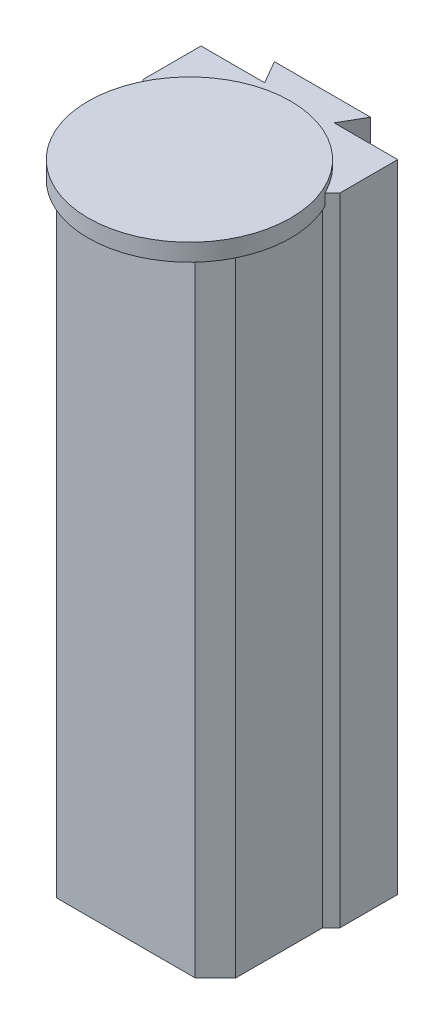
ISO-10303-21;
HEADER;
FILE_DESCRIPTION(('STEP AP214'),'2;1');
FILE_NAME('part.step','',(''),(''),'','','');
FILE_SCHEMA(('AUTOMOTIVE_DESIGN { 1 0 10303 214 1 1 1 1 }'));
ENDSEC;
DATA;
#1=APPLICATION_CONTEXT('core data for automotive mechanical design processes');
#2=APPLICATION_PROTOCOL_DEFINITION('international standard','automotive_design',2000,#1);
#3=PRODUCT_CONTEXT('',#1,'mechanical');
#4=PRODUCT('Part','Part','',(#3));
#5=PRODUCT_RELATED_PRODUCT_CATEGORY('part','',(#4));
#6=PRODUCT_DEFINITION_FORMATION('','',#4);
#7=PRODUCT_DEFINITION_CONTEXT('part definition',#1,'design');
#8=PRODUCT_DEFINITION('design','',#6,#7);
#9=PRODUCT_DEFINITION_SHAPE('','',#8);
#10=(LENGTH_UNIT() NAMED_UNIT(*) SI_UNIT(.MILLI.,.METRE.));
#11=(NAMED_UNIT(*) PLANE_ANGLE_UNIT() SI_UNIT($,.RADIAN.));
#12=(NAMED_UNIT(*) SI_UNIT($,.STERADIAN.) SOLID_ANGLE_UNIT());
#13=UNCERTAINTY_MEASURE_WITH_UNIT(LENGTH_MEASURE(1.E-05),#10,'distance_accuracy_value','');
#14=(GEOMETRIC_REPRESENTATION_CONTEXT(3) GLOBAL_UNCERTAINTY_ASSIGNED_CONTEXT((#13)) GLOBAL_UNIT_ASSIGNED_CONTEXT((#10,
#11,#12)) REPRESENTATION_CONTEXT('',''));
#15=CARTESIAN_POINT('',(0.,0.,0.));
#16=DIRECTION('',(0.,0.,1.));
#17=DIRECTION('',(1.,0.,0.));
#18=AXIS2_PLACEMENT_3D('',#15,#16,#17);
#19=CARTESIAN_POINT('',(0.,-230.,0.));
#20=DIRECTION('',(0.,1.,0.));
#21=DIRECTION('',(0.,0.,1.));
#22=AXIS2_PLACEMENT_3D('',#19,#20,#21);
#23=PLANE('',#22);
#24=CARTESIAN_POINT('',(0.,-230.,580.));
#25=DIRECTION('',(0.,1.,0.));
#26=DIRECTION('',(0.,0.,1.));
#27=AXIS2_PLACEMENT_3D('',#24,#25,#26);
#28=CIRCLE('',#27,175.);
#29=CARTESIAN_POINT('',(0.,-230.,755.));
#30=VERTEX_POINT('',#29);
#31=EDGE_CURVE('E19',#30,#30,#28,.F.);
#32=ORIENTED_EDGE('',*,*,#31,.F.);
#33=EDGE_LOOP('',(#32));
#34=FACE_BOUND('',#33,.T.);
#35=ADVANCED_FACE('F16',(#34),#23,.T.);
#36=CARTESIAN_POINT('',(0.,-240.,0.));
#37=DIRECTION('',(0.,1.,0.));
#38=DIRECTION('',(0.,0.,1.));
#39=AXIS2_PLACEMENT_3D('',#36,#37,#38);
#40=PLANE('',#39);
#41=DIRECTION('',(-0.707106781186548,0.,-0.707106781186548));
#42=VECTOR('',#41,1.);
#43=CARTESIAN_POINT('',(-170.,-240.,490.));
#44=LINE('',#43,#42);
#45=CARTESIAN_POINT('',(-170.,-240.,490.));
#46=VERTEX_POINT('',#45);
#47=CARTESIAN_POINT('',(-157.100384286152,-240.,502.899615713848));
#48=VERTEX_POINT('',#47);
#49=EDGE_CURVE('E135',#46,#48,#44,.F.);
#50=ORIENTED_EDGE('',*,*,#49,.T.);
#51=CARTESIAN_POINT('',(0.,-240.,580.));
#52=DIRECTION('',(0.,1.,0.));
#53=DIRECTION('',(0.,0.,1.));
#54=AXIS2_PLACEMENT_3D('',#51,#52,#53);
#55=CIRCLE('',#54,175.);
#56=CARTESIAN_POINT('',(157.100384286152,-240.,502.899615713848));
#57=VERTEX_POINT('',#56);
#58=EDGE_CURVE('E128',#57,#48,#55,.T.);
#59=ORIENTED_EDGE('',*,*,#58,.F.);
#60=DIRECTION('',(0.707106781186548,0.,-0.707106781186548));
#61=VECTOR('',#60,1.);
#62=CARTESIAN_POINT('',(170.,-240.,490.));
#63=LINE('',#62,#61);
#64=CARTESIAN_POINT('',(170.,-240.,490.));
#65=VERTEX_POINT('',#64);
#66=EDGE_CURVE('E132',#65,#57,#63,.F.);
#67=ORIENTED_EDGE('',*,*,#66,.F.);
#68=DIRECTION('',(0.,0.,1.));
#69=VECTOR('',#68,1.);
#70=CARTESIAN_POINT('',(170.,-240.,490.));
#71=LINE('',#70,#69);
#72=CARTESIAN_POINT('',(170.,-240.,390.));
#73=VERTEX_POINT('',#72);
#74=EDGE_CURVE('E160',#65,#73,#71,.F.);
#75=ORIENTED_EDGE('',*,*,#74,.T.);
#76=DIRECTION('',(1.,0.,0.));
#77=VECTOR('',#76,1.);
#78=CARTESIAN_POINT('',(-60.,-240.,390.));
#79=LINE('',#78,#77);
#80=CARTESIAN_POINT('',(60.,-240.,390.));
#81=VERTEX_POINT('',#80);
#82=EDGE_CURVE('E174',#73,#81,#79,.F.);
#83=ORIENTED_EDGE('',*,*,#82,.T.);
#84=DIRECTION('',(-0.50000000000019,0.,0.866025403784329));
#85=VECTOR('',#84,1.);
#86=CARTESIAN_POINT('',(60.,-240.,390.));
#87=LINE('',#86,#85);
#88=CARTESIAN_POINT('',(83.0940107675992,-240.,350.));
#89=VERTEX_POINT('',#88);
#90=EDGE_CURVE('E219',#81,#89,#87,.F.);
#91=ORIENTED_EDGE('',*,*,#90,.T.);
#92=DIRECTION('',(-1.,0.,0.));
#93=VECTOR('',#92,1.);
#94=CARTESIAN_POINT('',(-83.0940107676,-240.,350.));
#95=LINE('',#94,#93);
#96=CARTESIAN_POINT('',(-83.0940107675976,-240.,350.));
#97=VERTEX_POINT('',#96);
#98=EDGE_CURVE('E216',#97,#89,#95,.F.);
#99=ORIENTED_EDGE('',*,*,#98,.F.);
#100=DIRECTION('',(0.50000000000019,0.,0.866025403784329));
#101=VECTOR('',#100,1.);
#102=CARTESIAN_POINT('',(-60.,-240.,390.));
#103=LINE('',#102,#101);
#104=CARTESIAN_POINT('',(-60.,-240.,390.));
#105=VERTEX_POINT('',#104);
#106=EDGE_CURVE('E196',#105,#97,#103,.F.);
#107=ORIENTED_EDGE('',*,*,#106,.F.);
#108=DIRECTION('',(1.,0.,0.));
#109=VECTOR('',#108,1.);
#110=CARTESIAN_POINT('',(-60.,-240.,390.));
#111=LINE('',#110,#109);
#112=CARTESIAN_POINT('',(-170.,-240.,390.));
#113=VERTEX_POINT('',#112);
#114=EDGE_CURVE('E186',#105,#113,#111,.F.);
#115=ORIENTED_EDGE('',*,*,#114,.T.);
#116=DIRECTION('',(0.,0.,1.));
#117=VECTOR('',#116,1.);
#118=CARTESIAN_POINT('',(-170.,-240.,490.));
#119=LINE('',#118,#117);
#120=EDGE_CURVE('E183',#46,#113,#119,.F.);
#121=ORIENTED_EDGE('',*,*,#120,.F.);
#122=EDGE_LOOP('',(#50,#59,#67,#75,#83,#91,#99,#107,#115,#121));
#123=FACE_BOUND('',#122,.T.);
#124=ADVANCED_FACE('F130',(#123),#40,.T.);
#125=CARTESIAN_POINT('',(60.,-340.,390.));
#126=DIRECTION('',(-0.866025403784329,0.,-0.50000000000019));
#127=DIRECTION('',(-0.50000000000019,0.,0.866025403784329));
#128=AXIS2_PLACEMENT_3D('',#125,#126,#127);
#129=PLANE('',#128);
#130=DIRECTION('',(0.,1.,0.));
#131=VECTOR('',#130,1.);
#132=CARTESIAN_POINT('',(83.0940107676,-340.,350.));
#133=LINE('',#132,#131);
#134=CARTESIAN_POINT('',(83.0940107675988,-1340.,350.));
#135=VERTEX_POINT('',#134);
#136=EDGE_CURVE('E199',#89,#135,#133,.F.);
#137=ORIENTED_EDGE('',*,*,#136,.F.);
#138=ORIENTED_EDGE('',*,*,#90,.F.);
#139=DIRECTION('',(0.,1.,0.));
#140=VECTOR('',#139,1.);
#141=CARTESIAN_POINT('',(60.,-340.,390.));
#142=LINE('',#141,#140);
#143=CARTESIAN_POINT('',(60.,-1340.,390.));
#144=VERTEX_POINT('',#143);
#145=EDGE_CURVE('E178',#81,#144,#142,.F.);
#146=ORIENTED_EDGE('',*,*,#145,.T.);
#147=DIRECTION('',(0.500000000000243,0.,-0.866025403784298));
#148=VECTOR('',#147,1.);
#149=CARTESIAN_POINT('',(60.,-1340.,390.));
#150=LINE('',#149,#148);
#151=EDGE_CURVE('E247',#144,#135,#150,.T.);
#152=ORIENTED_EDGE('',*,*,#151,.T.);
#153=EDGE_LOOP('',(#137,#138,#146,#152));
#154=FACE_BOUND('',#153,.T.);
#155=ADVANCED_FACE('F333',(#154),#129,.F.);
#156=CARTESIAN_POINT('',(-83.0940107676,-340.,350.));
#157=DIRECTION('',(0.,0.,-1.));
#158=DIRECTION('',(-1.,0.,0.));
#159=AXIS2_PLACEMENT_3D('',#156,#157,#158);
#160=PLANE('',#159);
#161=ORIENTED_EDGE('',*,*,#98,.T.);
#162=ORIENTED_EDGE('',*,*,#136,.T.);
#163=DIRECTION('',(1.,0.,0.));
#164=VECTOR('',#163,1.);
#165=CARTESIAN_POINT('',(0.,-1340.,350.));
#166=LINE('',#165,#164);
#167=CARTESIAN_POINT('',(-83.0940107675994,-1340.,350.));
#168=VERTEX_POINT('',#167);
#169=EDGE_CURVE('E205',#135,#168,#166,.F.);
#170=ORIENTED_EDGE('',*,*,#169,.T.);
#171=DIRECTION('',(0.,1.,0.));
#172=VECTOR('',#171,1.);
#173=CARTESIAN_POINT('',(-83.0940107675976,-340.,350.));
#174=LINE('',#173,#172);
#175=EDGE_CURVE('E193',#97,#168,#174,.F.);
#176=ORIENTED_EDGE('',*,*,#175,.F.);
#177=EDGE_LOOP('',(#161,#162,#170,#176));
#178=FACE_BOUND('',#177,.T.);
#179=ADVANCED_FACE('F337',(#178),#160,.T.);
#180=CARTESIAN_POINT('',(-60.,-340.,390.));
#181=DIRECTION('',(-0.866025403784329,0.,0.50000000000019));
#182=DIRECTION('',(0.50000000000019,0.,0.866025403784329));
#183=AXIS2_PLACEMENT_3D('',#180,#181,#182);
#184=PLANE('',#183);
#185=ORIENTED_EDGE('',*,*,#106,.T.);
#186=ORIENTED_EDGE('',*,*,#175,.T.);
#187=DIRECTION('',(0.500000000000243,0.,0.866025403784298));
#188=VECTOR('',#187,1.);
#189=CARTESIAN_POINT('',(-83.0940107676,-1340.,350.));
#190=LINE('',#189,#188);
#191=CARTESIAN_POINT('',(-60.,-1340.,390.));
#192=VERTEX_POINT('',#191);
#193=EDGE_CURVE('E202',#168,#192,#190,.T.);
#194=ORIENTED_EDGE('',*,*,#193,.T.);
#195=DIRECTION('',(0.,1.,0.));
#196=VECTOR('',#195,1.);
#197=CARTESIAN_POINT('',(-60.,-340.,390.));
#198=LINE('',#197,#196);
#199=EDGE_CURVE('E188',#192,#105,#198,.T.);
#200=ORIENTED_EDGE('',*,*,#199,.T.);
#201=EDGE_LOOP('',(#185,#186,#194,#200));
#202=FACE_BOUND('',#201,.T.);
#203=ADVANCED_FACE('F342',(#202),#184,.T.);
#204=CARTESIAN_POINT('',(-60.,-340.,390.));
#205=DIRECTION('',(0.,0.,1.));
#206=DIRECTION('',(1.,0.,0.));
#207=AXIS2_PLACEMENT_3D('',#204,#205,#206);
#208=PLANE('',#207);
#209=DIRECTION('',(0.,1.,0.));
#210=VECTOR('',#209,1.);
#211=CARTESIAN_POINT('',(-170.,-340.,390.));
#212=LINE('',#211,#210);
#213=CARTESIAN_POINT('',(-170.,-1340.,390.));
#214=VERTEX_POINT('',#213);
#215=EDGE_CURVE('E163',#113,#214,#212,.F.);
#216=ORIENTED_EDGE('',*,*,#215,.F.);
#217=ORIENTED_EDGE('',*,*,#114,.F.);
#218=ORIENTED_EDGE('',*,*,#199,.F.);
#219=DIRECTION('',(1.,0.,0.));
#220=VECTOR('',#219,1.);
#221=CARTESIAN_POINT('',(0.,-1340.,390.));
#222=LINE('',#221,#220);
#223=EDGE_CURVE('E204',#192,#214,#222,.F.);
#224=ORIENTED_EDGE('',*,*,#223,.T.);
#225=EDGE_LOOP('',(#216,#217,#218,#224));
#226=FACE_BOUND('',#225,.T.);
#227=ADVANCED_FACE('F346',(#226),#208,.F.);
#228=CARTESIAN_POINT('',(-170.,-340.,490.));
#229=DIRECTION('',(-1.,0.,0.));
#230=DIRECTION('',(0.,0.,1.));
#231=AXIS2_PLACEMENT_3D('',#228,#229,#230);
#232=PLANE('',#231);
#233=ORIENTED_EDGE('',*,*,#120,.T.);
#234=ORIENTED_EDGE('',*,*,#215,.T.);
#235=DIRECTION('',(0.,0.,1.));
#236=VECTOR('',#235,1.);
#237=CARTESIAN_POINT('',(-170.,-1340.,0.));
#238=LINE('',#237,#236);
#239=CARTESIAN_POINT('',(-170.,-1340.,490.));
#240=VERTEX_POINT('',#239);
#241=EDGE_CURVE('E209',#214,#240,#238,.T.);
#242=ORIENTED_EDGE('',*,*,#241,.T.);
#243=DIRECTION('',(0.,1.,0.));
#244=VECTOR('',#243,1.);
#245=CARTESIAN_POINT('',(-170.,-340.,490.));
#246=LINE('',#245,#244);
#247=EDGE_CURVE('E254',#240,#46,#246,.T.);
#248=ORIENTED_EDGE('',*,*,#247,.T.);
#249=EDGE_LOOP('',(#233,#234,#242,#248));
#250=FACE_BOUND('',#249,.T.);
#251=ADVANCED_FACE('F349',(#250),#232,.T.);
#252=CARTESIAN_POINT('',(170.,-340.,490.));
#253=DIRECTION('',(-1.,0.,0.));
#254=DIRECTION('',(0.,0.,1.));
#255=AXIS2_PLACEMENT_3D('',#252,#253,#254);
#256=PLANE('',#255);
#257=DIRECTION('',(0.,1.,0.));
#258=VECTOR('',#257,1.);
#259=CARTESIAN_POINT('',(170.,-340.,390.));
#260=LINE('',#259,#258);
#261=CARTESIAN_POINT('',(170.,-1340.,390.));
#262=VERTEX_POINT('',#261);
#263=EDGE_CURVE('E162',#262,#73,#260,.T.);
#264=ORIENTED_EDGE('',*,*,#263,.T.);
#265=ORIENTED_EDGE('',*,*,#74,.F.);
#266=DIRECTION('',(0.,1.,0.));
#267=VECTOR('',#266,1.);
#268=CARTESIAN_POINT('',(170.,-340.,490.));
#269=LINE('',#268,#267);
#270=CARTESIAN_POINT('',(170.,-1340.,490.));
#271=VERTEX_POINT('',#270);
#272=EDGE_CURVE('E139',#271,#65,#269,.T.);
#273=ORIENTED_EDGE('',*,*,#272,.F.);
#274=DIRECTION('',(0.,0.,1.));
#275=VECTOR('',#274,1.);
#276=CARTESIAN_POINT('',(170.,-1340.,0.));
#277=LINE('',#276,#275);
#278=EDGE_CURVE('E166',#271,#262,#277,.F.);
#279=ORIENTED_EDGE('',*,*,#278,.T.);
#280=EDGE_LOOP('',(#264,#265,#273,#279));
#281=FACE_BOUND('',#280,.T.);
#282=ADVANCED_FACE('F325',(#281),#256,.F.);
#283=CARTESIAN_POINT('',(-60.,-340.,390.));
#284=DIRECTION('',(0.,0.,1.));
#285=DIRECTION('',(1.,0.,0.));
#286=AXIS2_PLACEMENT_3D('',#283,#284,#285);
#287=PLANE('',#286);
#288=ORIENTED_EDGE('',*,*,#145,.F.);
#289=ORIENTED_EDGE('',*,*,#82,.F.);
#290=ORIENTED_EDGE('',*,*,#263,.F.);
#291=DIRECTION('',(1.,0.,0.));
#292=VECTOR('',#291,1.);
#293=CARTESIAN_POINT('',(0.,-1340.,390.));
#294=LINE('',#293,#292);
#295=EDGE_CURVE('E168',#262,#144,#294,.F.);
#296=ORIENTED_EDGE('',*,*,#295,.T.);
#297=EDGE_LOOP('',(#288,#289,#290,#296));
#298=FACE_BOUND('',#297,.T.);
#299=ADVANCED_FACE('F329',(#298),#287,.F.);
#300=CARTESIAN_POINT('',(0.,-245.,580.));
#301=DIRECTION('',(0.,1.,0.));
#302=DIRECTION('',(0.,0.,1.));
#303=AXIS2_PLACEMENT_3D('',#300,#301,#302);
#304=CYLINDRICAL_SURFACE('',#303,175.);
#305=ORIENTED_EDGE('',*,*,#31,.T.);
#306=EDGE_LOOP('',(#305));
#307=FACE_BOUND('',#306,.T.);
#308=ORIENTED_EDGE('',*,*,#58,.T.);
#309=DIRECTION('',(0.,1.,0.));
#310=VECTOR('',#309,1.);
#311=CARTESIAN_POINT('',(-157.100384286,-340.,502.899615714));
#312=LINE('',#311,#310);
#313=CARTESIAN_POINT('',(-157.100384286152,-260.,502.899615713848));
#314=VERTEX_POINT('',#313);
#315=EDGE_CURVE('E250',#48,#314,#312,.F.);
#316=ORIENTED_EDGE('',*,*,#315,.T.);
#317=CARTESIAN_POINT('',(0.,-260.,580.));
#318=DIRECTION('',(0.,1.,0.));
#319=DIRECTION('',(0.,0.,1.));
#320=AXIS2_PLACEMENT_3D('',#317,#318,#319);
#321=CIRCLE('',#320,175.);
#322=CARTESIAN_POINT('',(157.100384286152,-260.,502.899615713848));
#323=VERTEX_POINT('',#322);
#324=EDGE_CURVE('E143',#314,#323,#321,.T.);
#325=ORIENTED_EDGE('',*,*,#324,.T.);
#326=DIRECTION('',(0.,1.,0.));
#327=VECTOR('',#326,1.);
#328=CARTESIAN_POINT('',(157.100384286,-340.,502.899615714));
#329=LINE('',#328,#327);
#330=EDGE_CURVE('E141',#57,#323,#329,.F.);
#331=ORIENTED_EDGE('',*,*,#330,.F.);
#332=EDGE_LOOP('',(#308,#316,#325,#331));
#333=FACE_BOUND('',#332,.T.);
#334=ADVANCED_FACE('F142',(#307,#333),#304,.T.);
#335=CARTESIAN_POINT('',(170.,-340.,490.));
#336=DIRECTION('',(0.707106781186548,0.,0.707106781186548));
#337=DIRECTION('',(0.707106781186548,0.,-0.707106781186548));
#338=AXIS2_PLACEMENT_3D('',#335,#336,#337);
#339=PLANE('',#338);
#340=ORIENTED_EDGE('',*,*,#330,.T.);
#341=DIRECTION('',(-0.707106781186548,0.,0.707106781186548));
#342=VECTOR('',#341,1.);
#343=CARTESIAN_POINT('',(157.100384286,-260.,502.899615714));
#344=LINE('',#343,#342);
#345=CARTESIAN_POINT('',(155.,-260.,505.));
#346=VERTEX_POINT('',#345);
#347=EDGE_CURVE('E232',#323,#346,#344,.T.);
#348=ORIENTED_EDGE('',*,*,#347,.T.);
#349=DIRECTION('',(0.,1.,0.));
#350=VECTOR('',#349,1.);
#351=CARTESIAN_POINT('',(155.,-340.,505.));
#352=LINE('',#351,#350);
#353=CARTESIAN_POINT('',(155.,-1340.,505.));
#354=VERTEX_POINT('',#353);
#355=EDGE_CURVE('E146',#354,#346,#352,.T.);
#356=ORIENTED_EDGE('',*,*,#355,.F.);
#357=DIRECTION('',(0.707106781186548,0.,-0.707106781186548));
#358=VECTOR('',#357,1.);
#359=CARTESIAN_POINT('',(155.,-1340.,505.));
#360=LINE('',#359,#358);
#361=EDGE_CURVE('E169',#354,#271,#360,.T.);
#362=ORIENTED_EDGE('',*,*,#361,.T.);
#363=ORIENTED_EDGE('',*,*,#272,.T.);
#364=ORIENTED_EDGE('',*,*,#66,.T.);
#365=EDGE_LOOP('',(#340,#348,#356,#362,#363,#364));
#366=FACE_BOUND('',#365,.T.);
#367=ADVANCED_FACE('F148',(#366),#339,.T.);
#368=CARTESIAN_POINT('',(155.,-340.,505.));
#369=DIRECTION('',(1.,0.,0.));
#370=DIRECTION('',(0.,0.,-1.));
#371=AXIS2_PLACEMENT_3D('',#368,#369,#370);
#372=PLANE('',#371);
#373=ORIENTED_EDGE('',*,*,#355,.T.);
#374=DIRECTION('',(0.,0.,1.));
#375=VECTOR('',#374,1.);
#376=CARTESIAN_POINT('',(155.,-260.,0.));
#377=LINE('',#376,#375);
#378=CARTESIAN_POINT('',(155.,-260.,655.));
#379=VERTEX_POINT('',#378);
#380=EDGE_CURVE('E234',#346,#379,#377,.T.);
#381=ORIENTED_EDGE('',*,*,#380,.T.);
#382=DIRECTION('',(0.,1.,0.));
#383=VECTOR('',#382,1.);
#384=CARTESIAN_POINT('',(155.,-340.,655.));
#385=LINE('',#384,#383);
#386=CARTESIAN_POINT('',(155.,-1340.,655.));
#387=VERTEX_POINT('',#386);
#388=EDGE_CURVE('E233',#387,#379,#385,.T.);
#389=ORIENTED_EDGE('',*,*,#388,.F.);
#390=DIRECTION('',(0.,0.,1.));
#391=VECTOR('',#390,1.);
#392=CARTESIAN_POINT('',(155.,-1340.,0.));
#393=LINE('',#392,#391);
#394=EDGE_CURVE('E293',#387,#354,#393,.F.);
#395=ORIENTED_EDGE('',*,*,#394,.T.);
#396=EDGE_LOOP('',(#373,#381,#389,#395));
#397=FACE_BOUND('',#396,.T.);
#398=ADVANCED_FACE('F373',(#397),#372,.T.);
#399=CARTESIAN_POINT('',(-155.,-340.,505.));
#400=DIRECTION('',(1.,0.,0.));
#401=DIRECTION('',(0.,0.,-1.));
#402=AXIS2_PLACEMENT_3D('',#399,#400,#401);
#403=PLANE('',#402);
#404=DIRECTION('',(0.,1.,0.));
#405=VECTOR('',#404,1.);
#406=CARTESIAN_POINT('',(-155.,-340.,505.));
#407=LINE('',#406,#405);
#408=CARTESIAN_POINT('',(-155.,-260.,505.));
#409=VERTEX_POINT('',#408);
#410=CARTESIAN_POINT('',(-155.,-1340.,505.));
#411=VERTEX_POINT('',#410);
#412=EDGE_CURVE('E252',#409,#411,#407,.F.);
#413=ORIENTED_EDGE('',*,*,#412,.T.);
#414=DIRECTION('',(0.,0.,1.));
#415=VECTOR('',#414,1.);
#416=CARTESIAN_POINT('',(-155.,-1340.,0.));
#417=LINE('',#416,#415);
#418=CARTESIAN_POINT('',(-155.,-1340.,655.));
#419=VERTEX_POINT('',#418);
#420=EDGE_CURVE('E286',#411,#419,#417,.T.);
#421=ORIENTED_EDGE('',*,*,#420,.T.);
#422=DIRECTION('',(0.,1.,0.));
#423=VECTOR('',#422,1.);
#424=CARTESIAN_POINT('',(-155.,-340.,655.));
#425=LINE('',#424,#423);
#426=CARTESIAN_POINT('',(-155.,-260.,655.));
#427=VERTEX_POINT('',#426);
#428=EDGE_CURVE('E249',#427,#419,#425,.F.);
#429=ORIENTED_EDGE('',*,*,#428,.F.);
#430=DIRECTION('',(0.,0.,1.));
#431=VECTOR('',#430,1.);
#432=CARTESIAN_POINT('',(-155.,-260.,0.));
#433=LINE('',#432,#431);
#434=EDGE_CURVE('E257',#427,#409,#433,.F.);
#435=ORIENTED_EDGE('',*,*,#434,.T.);
#436=EDGE_LOOP('',(#413,#421,#429,#435));
#437=FACE_BOUND('',#436,.T.);
#438=ADVANCED_FACE('F381',(#437),#403,.F.);
#439=CARTESIAN_POINT('',(-170.,-340.,490.));
#440=DIRECTION('',(0.707106781186548,0.,-0.707106781186548));
#441=DIRECTION('',(-0.707106781186548,0.,-0.707106781186548));
#442=AXIS2_PLACEMENT_3D('',#439,#440,#441);
#443=PLANE('',#442);
#444=ORIENTED_EDGE('',*,*,#315,.F.);
#445=ORIENTED_EDGE('',*,*,#49,.F.);
#446=ORIENTED_EDGE('',*,*,#247,.F.);
#447=DIRECTION('',(0.707106781186548,0.,0.707106781186548));
#448=VECTOR('',#447,1.);
#449=CARTESIAN_POINT('',(-170.,-1340.,490.));
#450=LINE('',#449,#448);
#451=EDGE_CURVE('E289',#240,#411,#450,.T.);
#452=ORIENTED_EDGE('',*,*,#451,.T.);
#453=ORIENTED_EDGE('',*,*,#412,.F.);
#454=DIRECTION('',(-0.707106781186548,0.,-0.707106781186548));
#455=VECTOR('',#454,1.);
#456=CARTESIAN_POINT('',(-155.,-260.,505.));
#457=LINE('',#456,#455);
#458=EDGE_CURVE('E259',#409,#314,#457,.T.);
#459=ORIENTED_EDGE('',*,*,#458,.T.);
#460=EDGE_LOOP('',(#444,#445,#446,#452,#453,#459));
#461=FACE_BOUND('',#460,.T.);
#462=ADVANCED_FACE('F353',(#461),#443,.F.);
#463=CARTESIAN_POINT('',(-120.,-340.,690.));
#464=DIRECTION('',(-0.707106781186548,0.,0.707106781186548));
#465=DIRECTION('',(0.707106781186548,0.,0.707106781186548));
#466=AXIS2_PLACEMENT_3D('',#463,#464,#465);
#467=PLANE('',#466);
#468=DIRECTION('',(0.,1.,0.));
#469=VECTOR('',#468,1.);
#470=CARTESIAN_POINT('',(-120.,-340.,690.));
#471=LINE('',#470,#469);
#472=CARTESIAN_POINT('',(-120.,-260.,690.));
#473=VERTEX_POINT('',#472);
#474=CARTESIAN_POINT('',(-120.,-1340.,690.));
#475=VERTEX_POINT('',#474);
#476=EDGE_CURVE('E271',#473,#475,#471,.F.);
#477=ORIENTED_EDGE('',*,*,#476,.F.);
#478=DIRECTION('',(-0.707106781186547,0.,-0.707106781186548));
#479=VECTOR('',#478,1.);
#480=CARTESIAN_POINT('',(-120.,-260.,690.));
#481=LINE('',#480,#479);
#482=EDGE_CURVE('E260',#473,#427,#481,.T.);
#483=ORIENTED_EDGE('',*,*,#482,.T.);
#484=ORIENTED_EDGE('',*,*,#428,.T.);
#485=DIRECTION('',(0.707106781186547,0.,0.707106781186548));
#486=VECTOR('',#485,1.);
#487=CARTESIAN_POINT('',(-155.,-1340.,655.));
#488=LINE('',#487,#486);
#489=EDGE_CURVE('E288',#419,#475,#488,.T.);
#490=ORIENTED_EDGE('',*,*,#489,.T.);
#491=EDGE_LOOP('',(#477,#483,#484,#490));
#492=FACE_BOUND('',#491,.T.);
#493=ADVANCED_FACE('F378',(#492),#467,.T.);
#494=CARTESIAN_POINT('',(0.,-1340.,0.));
#495=DIRECTION('',(0.,1.,0.));
#496=DIRECTION('',(0.,0.,1.));
#497=AXIS2_PLACEMENT_3D('',#494,#495,#496);
#498=PLANE('',#497);
#499=ORIENTED_EDGE('',*,*,#278,.F.);
#500=ORIENTED_EDGE('',*,*,#361,.F.);
#501=ORIENTED_EDGE('',*,*,#394,.F.);
#502=DIRECTION('',(0.707106781186548,0.,-0.707106781186548));
#503=VECTOR('',#502,1.);
#504=CARTESIAN_POINT('',(155.,-1340.,655.));
#505=LINE('',#504,#503);
#506=CARTESIAN_POINT('',(120.,-1340.,690.));
#507=VERTEX_POINT('',#506);
#508=EDGE_CURVE('E236',#507,#387,#505,.T.);
#509=ORIENTED_EDGE('',*,*,#508,.F.);
#510=DIRECTION('',(1.,0.,0.));
#511=VECTOR('',#510,1.);
#512=CARTESIAN_POINT('',(120.,-1340.,690.));
#513=LINE('',#512,#511);
#514=EDGE_CURVE('E274',#475,#507,#513,.T.);
#515=ORIENTED_EDGE('',*,*,#514,.F.);
#516=ORIENTED_EDGE('',*,*,#489,.F.);
#517=ORIENTED_EDGE('',*,*,#420,.F.);
#518=ORIENTED_EDGE('',*,*,#451,.F.);
#519=ORIENTED_EDGE('',*,*,#241,.F.);
#520=ORIENTED_EDGE('',*,*,#223,.F.);
#521=ORIENTED_EDGE('',*,*,#193,.F.);
#522=ORIENTED_EDGE('',*,*,#169,.F.);
#523=ORIENTED_EDGE('',*,*,#151,.F.);
#524=ORIENTED_EDGE('',*,*,#295,.F.);
#525=EDGE_LOOP('',(#499,#500,#501,#509,#515,#516,#517,#518,#519,#520,#521,#522,#523,#524));
#526=FACE_BOUND('',#525,.T.);
#527=ADVANCED_FACE('F321',(#526),#498,.F.);
#528=CARTESIAN_POINT('',(155.,-340.,655.));
#529=DIRECTION('',(0.707106781186548,0.,0.707106781186548));
#530=DIRECTION('',(0.707106781186548,0.,-0.707106781186548));
#531=AXIS2_PLACEMENT_3D('',#528,#529,#530);
#532=PLANE('',#531);
#533=ORIENTED_EDGE('',*,*,#388,.T.);
#534=DIRECTION('',(-0.707106781186547,0.,0.707106781186548));
#535=VECTOR('',#534,1.);
#536=CARTESIAN_POINT('',(155.,-260.,655.));
#537=LINE('',#536,#535);
#538=CARTESIAN_POINT('',(120.,-260.,690.));
#539=VERTEX_POINT('',#538);
#540=EDGE_CURVE('E34',#379,#539,#537,.T.);
#541=ORIENTED_EDGE('',*,*,#540,.T.);
#542=DIRECTION('',(0.,1.,0.));
#543=VECTOR('',#542,1.);
#544=CARTESIAN_POINT('',(120.,-340.,690.));
#545=LINE('',#544,#543);
#546=EDGE_CURVE('E25',#507,#539,#545,.T.);
#547=ORIENTED_EDGE('',*,*,#546,.F.);
#548=ORIENTED_EDGE('',*,*,#508,.T.);
#549=EDGE_LOOP('',(#533,#541,#547,#548));
#550=FACE_BOUND('',#549,.T.);
#551=ADVANCED_FACE('F370',(#550),#532,.T.);
#552=CARTESIAN_POINT('',(0.,-260.,0.));
#553=DIRECTION('',(0.,1.,0.));
#554=DIRECTION('',(0.,0.,1.));
#555=AXIS2_PLACEMENT_3D('',#552,#553,#554);
#556=PLANE('',#555);
#557=ORIENTED_EDGE('',*,*,#434,.F.);
#558=ORIENTED_EDGE('',*,*,#482,.F.);
#559=DIRECTION('',(1.,0.,0.));
#560=VECTOR('',#559,1.);
#561=CARTESIAN_POINT('',(120.,-260.,690.));
#562=LINE('',#561,#560);
#563=EDGE_CURVE('E11',#539,#473,#562,.F.);
#564=ORIENTED_EDGE('',*,*,#563,.F.);
#565=ORIENTED_EDGE('',*,*,#540,.F.);
#566=ORIENTED_EDGE('',*,*,#380,.F.);
#567=ORIENTED_EDGE('',*,*,#347,.F.);
#568=ORIENTED_EDGE('',*,*,#324,.F.);
#569=ORIENTED_EDGE('',*,*,#458,.F.);
#570=EDGE_LOOP('',(#557,#558,#564,#565,#566,#567,#568,#569));
#571=FACE_BOUND('',#570,.T.);
#572=ADVANCED_FACE('F375',(#571),#556,.F.);
#573=CARTESIAN_POINT('',(120.,-340.,690.));
#574=DIRECTION('',(0.,0.,1.));
#575=DIRECTION('',(1.,0.,0.));
#576=AXIS2_PLACEMENT_3D('',#573,#574,#575);
#577=PLANE('',#576);
#578=ORIENTED_EDGE('',*,*,#546,.T.);
#579=ORIENTED_EDGE('',*,*,#563,.T.);
#580=ORIENTED_EDGE('',*,*,#476,.T.);
#581=ORIENTED_EDGE('',*,*,#514,.T.);
#582=EDGE_LOOP('',(#578,#579,#580,#581));
#583=FACE_BOUND('',#582,.T.);
#584=ADVANCED_FACE('F368',(#583),#577,.T.);
#585=CLOSED_SHELL('',(#35,#124,#155,#179,#203,#227,#251,#282,#299,#334,#367,#398,#438,#462,#493,
#527,#551,#572,#584));
#586=MANIFOLD_SOLID_BREP('B1',#585);
#587=ADVANCED_BREP_SHAPE_REPRESENTATION('',(#18,#586),#14);
#588=SHAPE_DEFINITION_REPRESENTATION(#9,#587);
ENDSEC;
END-ISO-10303-21;
